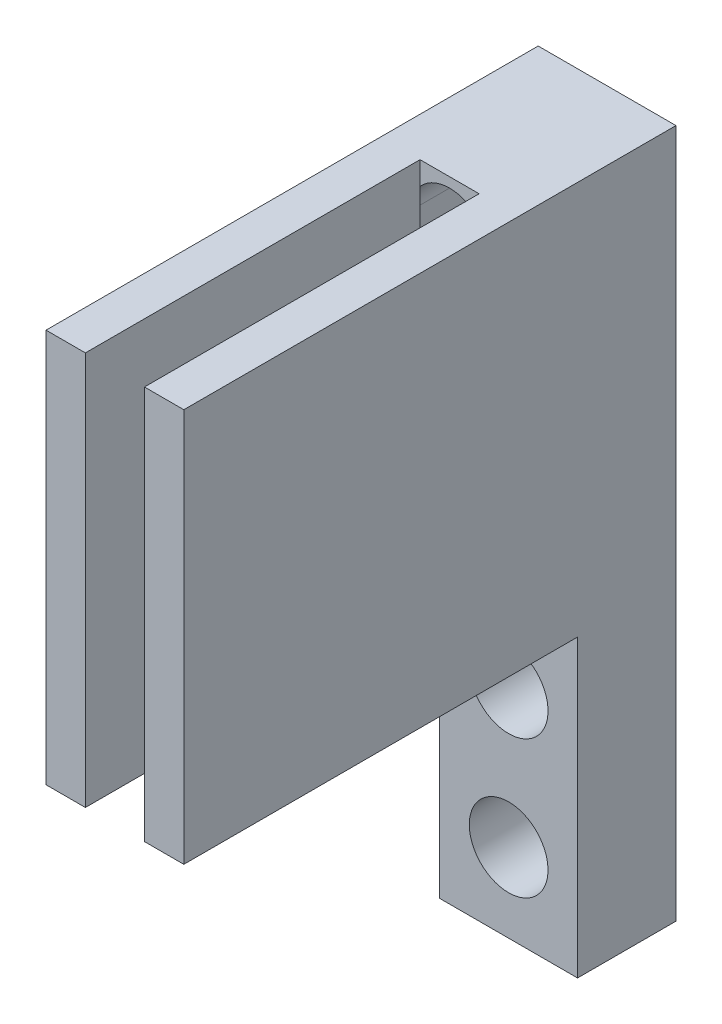
ISO-10303-21;
HEADER;
FILE_DESCRIPTION(('STEP AP214'),'2;1');
FILE_NAME('part.step','',(''),(''),'','','');
FILE_SCHEMA(('AUTOMOTIVE_DESIGN { 1 0 10303 214 1 1 1 1 }'));
ENDSEC;
DATA;
#1=APPLICATION_CONTEXT('core data for automotive mechanical design processes');
#2=APPLICATION_PROTOCOL_DEFINITION('international standard','automotive_design',2000,#1);
#3=PRODUCT_CONTEXT('',#1,'mechanical');
#4=PRODUCT('Part','Part','',(#3));
#5=PRODUCT_RELATED_PRODUCT_CATEGORY('part','',(#4));
#6=PRODUCT_DEFINITION_FORMATION('','',#4);
#7=PRODUCT_DEFINITION_CONTEXT('part definition',#1,'design');
#8=PRODUCT_DEFINITION('design','',#6,#7);
#9=PRODUCT_DEFINITION_SHAPE('','',#8);
#10=(LENGTH_UNIT() NAMED_UNIT(*) SI_UNIT(.MILLI.,.METRE.));
#11=(NAMED_UNIT(*) PLANE_ANGLE_UNIT() SI_UNIT($,.RADIAN.));
#12=(NAMED_UNIT(*) SI_UNIT($,.STERADIAN.) SOLID_ANGLE_UNIT());
#13=UNCERTAINTY_MEASURE_WITH_UNIT(LENGTH_MEASURE(1.E-05),#10,'distance_accuracy_value','');
#14=(GEOMETRIC_REPRESENTATION_CONTEXT(3) GLOBAL_UNCERTAINTY_ASSIGNED_CONTEXT((#13)) GLOBAL_UNIT_ASSIGNED_CONTEXT((#10,
#11,#12)) REPRESENTATION_CONTEXT('',''));
#15=CARTESIAN_POINT('',(0.,0.,0.));
#16=DIRECTION('',(0.,0.,1.));
#17=DIRECTION('',(1.,0.,0.));
#18=AXIS2_PLACEMENT_3D('',#15,#16,#17);
#19=CARTESIAN_POINT('',(-1.5,20.,-4.5));
#20=DIRECTION('',(0.,0.,-1.));
#21=DIRECTION('',(-1.,0.,0.));
#22=AXIS2_PLACEMENT_3D('',#19,#20,#21);
#23=PLANE('',#22);
#24=DIRECTION('',(0.,-1.,0.));
#25=VECTOR('',#24,1.);
#26=CARTESIAN_POINT('',(-1.5,20.,-4.5));
#27=LINE('',#26,#25);
#28=CARTESIAN_POINT('',(-1.5,20.,-4.5));
#29=VERTEX_POINT('',#28);
#30=CARTESIAN_POINT('',(-1.5,18.8228756555323,-4.5));
#31=VERTEX_POINT('',#30);
#32=EDGE_CURVE('E310',#29,#31,#27,.T.);
#33=ORIENTED_EDGE('',*,*,#32,.T.);
#34=CARTESIAN_POINT('',(0.,17.5,-4.5));
#35=DIRECTION('',(0.,0.,1.));
#36=DIRECTION('',(1.,0.,0.));
#37=AXIS2_PLACEMENT_3D('',#34,#35,#36);
#38=CIRCLE('',#37,2.);
#39=CARTESIAN_POINT('',(1.5,18.8228756555323,-4.5));
#40=VERTEX_POINT('',#39);
#41=EDGE_CURVE('E212',#40,#31,#38,.T.);
#42=ORIENTED_EDGE('',*,*,#41,.F.);
#43=DIRECTION('',(0.,-1.,0.));
#44=VECTOR('',#43,1.);
#45=CARTESIAN_POINT('',(1.5,20.,-4.5));
#46=LINE('',#45,#44);
#47=CARTESIAN_POINT('',(1.5,20.,-4.5));
#48=VERTEX_POINT('',#47);
#49=EDGE_CURVE('E304',#48,#40,#46,.T.);
#50=ORIENTED_EDGE('',*,*,#49,.F.);
#51=DIRECTION('',(1.,0.,0.));
#52=VECTOR('',#51,1.);
#53=CARTESIAN_POINT('',(-1.5,20.,-4.5));
#54=LINE('',#53,#52);
#55=EDGE_CURVE('E254',#29,#48,#54,.T.);
#56=ORIENTED_EDGE('',*,*,#55,.F.);
#57=EDGE_LOOP('',(#33,#42,#50,#56));
#58=FACE_BOUND('',#57,.T.);
#59=ADVANCED_FACE('F39',(#58),#23,.F.);
#60=CARTESIAN_POINT('',(-3.5,20.,12.5));
#61=DIRECTION('',(1.,0.,0.));
#62=DIRECTION('',(0.,0.,-1.));
#63=AXIS2_PLACEMENT_3D('',#60,#61,#62);
#64=PLANE('',#63);
#65=DIRECTION('',(0.,-1.,0.));
#66=VECTOR('',#65,1.);
#67=CARTESIAN_POINT('',(-3.5,20.,-12.5));
#68=LINE('',#67,#66);
#69=CARTESIAN_POINT('',(-3.5,20.,-12.5));
#70=VERTEX_POINT('',#69);
#71=CARTESIAN_POINT('',(-3.5,-15.,-12.5));
#72=VERTEX_POINT('',#71);
#73=EDGE_CURVE('E269',#70,#72,#68,.T.);
#74=ORIENTED_EDGE('',*,*,#73,.T.);
#75=DIRECTION('',(0.,0.,-1.));
#76=VECTOR('',#75,1.);
#77=CARTESIAN_POINT('',(-3.5,-15.,-7.5));
#78=LINE('',#77,#76);
#79=CARTESIAN_POINT('',(-3.5,-15.,-7.5));
#80=VERTEX_POINT('',#79);
#81=EDGE_CURVE('E166',#80,#72,#78,.T.);
#82=ORIENTED_EDGE('',*,*,#81,.F.);
#83=DIRECTION('',(0.,1.,0.));
#84=VECTOR('',#83,1.);
#85=CARTESIAN_POINT('',(-3.5,0.,-7.5));
#86=LINE('',#85,#84);
#87=CARTESIAN_POINT('',(-3.5,0.,-7.5));
#88=VERTEX_POINT('',#87);
#89=EDGE_CURVE('E171',#80,#88,#86,.T.);
#90=ORIENTED_EDGE('',*,*,#89,.T.);
#91=DIRECTION('',(0.,0.,1.));
#92=VECTOR('',#91,1.);
#93=CARTESIAN_POINT('',(-3.5,0.,12.5));
#94=LINE('',#93,#92);
#95=CARTESIAN_POINT('',(-3.5,0.,12.5));
#96=VERTEX_POINT('',#95);
#97=EDGE_CURVE('E243',#88,#96,#94,.T.);
#98=ORIENTED_EDGE('',*,*,#97,.T.);
#99=DIRECTION('',(0.,-1.,0.));
#100=VECTOR('',#99,1.);
#101=CARTESIAN_POINT('',(-3.5,20.,12.5));
#102=LINE('',#101,#100);
#103=CARTESIAN_POINT('',(-3.5,20.,12.5));
#104=VERTEX_POINT('',#103);
#105=EDGE_CURVE('E11',#104,#96,#102,.T.);
#106=ORIENTED_EDGE('',*,*,#105,.F.);
#107=DIRECTION('',(0.,0.,1.));
#108=VECTOR('',#107,1.);
#109=CARTESIAN_POINT('',(-3.5,20.,12.5));
#110=LINE('',#109,#108);
#111=EDGE_CURVE('E244',#70,#104,#110,.T.);
#112=ORIENTED_EDGE('',*,*,#111,.F.);
#113=EDGE_LOOP('',(#74,#82,#90,#98,#106,#112));
#114=FACE_BOUND('',#113,.T.);
#115=ADVANCED_FACE('F41',(#114),#64,.F.);
#116=CARTESIAN_POINT('',(-1.5,20.,12.5));
#117=DIRECTION('',(0.,0.,-1.));
#118=DIRECTION('',(-1.,0.,0.));
#119=AXIS2_PLACEMENT_3D('',#116,#117,#118);
#120=PLANE('',#119);
#121=DIRECTION('',(1.,0.,0.));
#122=VECTOR('',#121,1.);
#123=CARTESIAN_POINT('',(-1.5,0.,12.5));
#124=LINE('',#123,#122);
#125=CARTESIAN_POINT('',(-1.5,0.,12.5));
#126=VERTEX_POINT('',#125);
#127=EDGE_CURVE('E272',#96,#126,#124,.T.);
#128=ORIENTED_EDGE('',*,*,#127,.T.);
#129=DIRECTION('',(0.,-1.,0.));
#130=VECTOR('',#129,1.);
#131=CARTESIAN_POINT('',(-1.5,20.,12.5));
#132=LINE('',#131,#130);
#133=CARTESIAN_POINT('',(-1.5,20.,12.5));
#134=VERTEX_POINT('',#133);
#135=EDGE_CURVE('E48',#134,#126,#132,.T.);
#136=ORIENTED_EDGE('',*,*,#135,.F.);
#137=DIRECTION('',(1.,0.,0.));
#138=VECTOR('',#137,1.);
#139=CARTESIAN_POINT('',(-1.5,20.,12.5));
#140=LINE('',#139,#138);
#141=EDGE_CURVE('E248',#104,#134,#140,.T.);
#142=ORIENTED_EDGE('',*,*,#141,.F.);
#143=ORIENTED_EDGE('',*,*,#105,.T.);
#144=EDGE_LOOP('',(#128,#136,#142,#143));
#145=FACE_BOUND('',#144,.T.);
#146=ADVANCED_FACE('F381',(#145),#120,.F.);
#147=CARTESIAN_POINT('',(-1.5,20.,12.5));
#148=DIRECTION('',(-1.,0.,0.));
#149=DIRECTION('',(0.,0.,1.));
#150=AXIS2_PLACEMENT_3D('',#147,#148,#149);
#151=PLANE('',#150);
#152=DIRECTION('',(0.,0.,-1.));
#153=VECTOR('',#152,1.);
#154=CARTESIAN_POINT('',(-1.5,0.,12.5));
#155=LINE('',#154,#153);
#156=CARTESIAN_POINT('',(-1.5,0.,-4.5));
#157=VERTEX_POINT('',#156);
#158=EDGE_CURVE('E275',#126,#157,#155,.T.);
#159=ORIENTED_EDGE('',*,*,#158,.T.);
#160=CARTESIAN_POINT('',(-1.5,9.17712434446771,-4.5));
#161=VERTEX_POINT('',#160);
#162=EDGE_CURVE('E308',#161,#157,#27,.T.);
#163=ORIENTED_EDGE('',*,*,#162,.F.);
#164=DIRECTION('',(0.,1.,0.));
#165=VECTOR('',#164,1.);
#166=CARTESIAN_POINT('',(-1.5,20.,-4.5));
#167=LINE('',#166,#165);
#168=EDGE_CURVE('E239',#161,#31,#167,.T.);
#169=ORIENTED_EDGE('',*,*,#168,.T.);
#170=ORIENTED_EDGE('',*,*,#32,.F.);
#171=DIRECTION('',(0.,0.,-1.));
#172=VECTOR('',#171,1.);
#173=CARTESIAN_POINT('',(-1.5,20.,12.5));
#174=LINE('',#173,#172);
#175=EDGE_CURVE('E251',#134,#29,#174,.T.);
#176=ORIENTED_EDGE('',*,*,#175,.F.);
#177=ORIENTED_EDGE('',*,*,#135,.T.);
#178=EDGE_LOOP('',(#159,#163,#169,#170,#176,#177));
#179=FACE_BOUND('',#178,.T.);
#180=ADVANCED_FACE('F319',(#179),#151,.F.);
#181=CARTESIAN_POINT('',(1.5,9.1771243444677,-4.5));
#182=VERTEX_POINT('',#181);
#183=CARTESIAN_POINT('',(1.5,0.,-4.5));
#184=VERTEX_POINT('',#183);
#185=EDGE_CURVE('E303',#182,#184,#46,.T.);
#186=ORIENTED_EDGE('',*,*,#185,.F.);
#187=CARTESIAN_POINT('',(0.,10.5,-4.5));
#188=DIRECTION('',(0.,0.,1.));
#189=DIRECTION('',(1.,0.,0.));
#190=AXIS2_PLACEMENT_3D('',#187,#188,#189);
#191=CIRCLE('',#190,2.);
#192=EDGE_CURVE('E63',#161,#182,#191,.T.);
#193=ORIENTED_EDGE('',*,*,#192,.F.);
#194=ORIENTED_EDGE('',*,*,#162,.T.);
#195=DIRECTION('',(1.,0.,0.));
#196=VECTOR('',#195,1.);
#197=CARTESIAN_POINT('',(-1.5,0.,-4.5));
#198=LINE('',#197,#196);
#199=EDGE_CURVE('E279',#157,#184,#198,.T.);
#200=ORIENTED_EDGE('',*,*,#199,.T.);
#201=EDGE_LOOP('',(#186,#193,#194,#200));
#202=FACE_BOUND('',#201,.T.);
#203=ADVANCED_FACE('F332',(#202),#23,.F.);
#204=CARTESIAN_POINT('',(1.5,20.,-4.5));
#205=DIRECTION('',(1.,0.,0.));
#206=DIRECTION('',(0.,0.,-1.));
#207=AXIS2_PLACEMENT_3D('',#204,#205,#206);
#208=PLANE('',#207);
#209=DIRECTION('',(0.,0.,1.));
#210=VECTOR('',#209,1.);
#211=CARTESIAN_POINT('',(1.5,0.,-4.5));
#212=LINE('',#211,#210);
#213=CARTESIAN_POINT('',(1.5,0.,12.5));
#214=VERTEX_POINT('',#213);
#215=EDGE_CURVE('E283',#184,#214,#212,.T.);
#216=ORIENTED_EDGE('',*,*,#215,.T.);
#217=DIRECTION('',(0.,-1.,0.));
#218=VECTOR('',#217,1.);
#219=CARTESIAN_POINT('',(1.5,20.,12.5));
#220=LINE('',#219,#218);
#221=CARTESIAN_POINT('',(1.5,20.,12.5));
#222=VERTEX_POINT('',#221);
#223=EDGE_CURVE('E299',#222,#214,#220,.T.);
#224=ORIENTED_EDGE('',*,*,#223,.F.);
#225=DIRECTION('',(0.,0.,1.));
#226=VECTOR('',#225,1.);
#227=CARTESIAN_POINT('',(1.5,20.,-4.5));
#228=LINE('',#227,#226);
#229=EDGE_CURVE('E257',#48,#222,#228,.T.);
#230=ORIENTED_EDGE('',*,*,#229,.F.);
#231=ORIENTED_EDGE('',*,*,#49,.T.);
#232=EDGE_CURVE('E309',#40,#182,#46,.T.);
#233=ORIENTED_EDGE('',*,*,#232,.T.);
#234=ORIENTED_EDGE('',*,*,#185,.T.);
#235=EDGE_LOOP('',(#216,#224,#230,#231,#233,#234));
#236=FACE_BOUND('',#235,.T.);
#237=ADVANCED_FACE('F373',(#236),#208,.F.);
#238=CARTESIAN_POINT('',(3.5,20.,12.5));
#239=DIRECTION('',(0.,0.,-1.));
#240=DIRECTION('',(-1.,0.,0.));
#241=AXIS2_PLACEMENT_3D('',#238,#239,#240);
#242=PLANE('',#241);
#243=DIRECTION('',(1.,0.,0.));
#244=VECTOR('',#243,1.);
#245=CARTESIAN_POINT('',(3.5,0.,12.5));
#246=LINE('',#245,#244);
#247=CARTESIAN_POINT('',(3.5,0.,12.5));
#248=VERTEX_POINT('',#247);
#249=EDGE_CURVE('E286',#214,#248,#246,.T.);
#250=ORIENTED_EDGE('',*,*,#249,.T.);
#251=DIRECTION('',(0.,-1.,0.));
#252=VECTOR('',#251,1.);
#253=CARTESIAN_POINT('',(3.5,20.,12.5));
#254=LINE('',#253,#252);
#255=CARTESIAN_POINT('',(3.5,20.,12.5));
#256=VERTEX_POINT('',#255);
#257=EDGE_CURVE('E296',#256,#248,#254,.T.);
#258=ORIENTED_EDGE('',*,*,#257,.F.);
#259=DIRECTION('',(1.,0.,0.));
#260=VECTOR('',#259,1.);
#261=CARTESIAN_POINT('',(3.5,20.,12.5));
#262=LINE('',#261,#260);
#263=EDGE_CURVE('E260',#222,#256,#262,.T.);
#264=ORIENTED_EDGE('',*,*,#263,.F.);
#265=ORIENTED_EDGE('',*,*,#223,.T.);
#266=EDGE_LOOP('',(#250,#258,#264,#265));
#267=FACE_BOUND('',#266,.T.);
#268=ADVANCED_FACE('F384',(#267),#242,.F.);
#269=CARTESIAN_POINT('',(3.5,20.,12.5));
#270=DIRECTION('',(-1.,0.,0.));
#271=DIRECTION('',(0.,0.,1.));
#272=AXIS2_PLACEMENT_3D('',#269,#270,#271);
#273=PLANE('',#272);
#274=DIRECTION('',(0.,0.,-1.));
#275=VECTOR('',#274,1.);
#276=CARTESIAN_POINT('',(3.5,0.,12.5));
#277=LINE('',#276,#275);
#278=CARTESIAN_POINT('',(3.5,0.,-7.5));
#279=VERTEX_POINT('',#278);
#280=EDGE_CURVE('E178',#248,#279,#277,.T.);
#281=ORIENTED_EDGE('',*,*,#280,.T.);
#282=DIRECTION('',(0.,-1.,0.));
#283=VECTOR('',#282,1.);
#284=CARTESIAN_POINT('',(3.5,0.,-7.5));
#285=LINE('',#284,#283);
#286=CARTESIAN_POINT('',(3.5,-15.,-7.5));
#287=VERTEX_POINT('',#286);
#288=EDGE_CURVE('E55',#279,#287,#285,.T.);
#289=ORIENTED_EDGE('',*,*,#288,.T.);
#290=DIRECTION('',(0.,0.,-1.));
#291=VECTOR('',#290,1.);
#292=CARTESIAN_POINT('',(3.5,-15.,-7.5));
#293=LINE('',#292,#291);
#294=CARTESIAN_POINT('',(3.5,-15.,-12.5));
#295=VERTEX_POINT('',#294);
#296=EDGE_CURVE('E157',#287,#295,#293,.T.);
#297=ORIENTED_EDGE('',*,*,#296,.T.);
#298=DIRECTION('',(0.,-1.,0.));
#299=VECTOR('',#298,1.);
#300=CARTESIAN_POINT('',(3.5,20.,-12.5));
#301=LINE('',#300,#299);
#302=CARTESIAN_POINT('',(3.5,20.,-12.5));
#303=VERTEX_POINT('',#302);
#304=EDGE_CURVE('E293',#303,#295,#301,.T.);
#305=ORIENTED_EDGE('',*,*,#304,.F.);
#306=DIRECTION('',(0.,0.,-1.));
#307=VECTOR('',#306,1.);
#308=CARTESIAN_POINT('',(3.5,20.,12.5));
#309=LINE('',#308,#307);
#310=EDGE_CURVE('E263',#256,#303,#309,.T.);
#311=ORIENTED_EDGE('',*,*,#310,.F.);
#312=ORIENTED_EDGE('',*,*,#257,.T.);
#313=EDGE_LOOP('',(#281,#289,#297,#305,#311,#312));
#314=FACE_BOUND('',#313,.T.);
#315=ADVANCED_FACE('F175',(#314),#273,.F.);
#316=CARTESIAN_POINT('',(3.5,20.,-12.5));
#317=DIRECTION('',(0.,0.,1.));
#318=DIRECTION('',(1.,0.,0.));
#319=AXIS2_PLACEMENT_3D('',#316,#317,#318);
#320=PLANE('',#319);
#321=DIRECTION('',(0.,-1.,0.));
#322=VECTOR('',#321,1.);
#323=CARTESIAN_POINT('',(2.,17.5,-12.5));
#324=LINE('',#323,#322);
#325=CARTESIAN_POINT('',(2.,17.5,-12.5));
#326=VERTEX_POINT('',#325);
#327=CARTESIAN_POINT('',(2.,10.5,-12.5));
#328=VERTEX_POINT('',#327);
#329=EDGE_CURVE('E199',#326,#328,#324,.T.);
#330=ORIENTED_EDGE('',*,*,#329,.F.);
#331=CARTESIAN_POINT('',(0.,17.5,-12.5));
#332=DIRECTION('',(0.,0.,1.));
#333=DIRECTION('',(1.,0.,0.));
#334=AXIS2_PLACEMENT_3D('',#331,#332,#333);
#335=CIRCLE('',#334,2.);
#336=CARTESIAN_POINT('',(-2.,17.5,-12.5));
#337=VERTEX_POINT('',#336);
#338=EDGE_CURVE('E203',#337,#326,#335,.F.);
#339=ORIENTED_EDGE('',*,*,#338,.F.);
#340=DIRECTION('',(0.,1.,0.));
#341=VECTOR('',#340,1.);
#342=CARTESIAN_POINT('',(-2.,17.5,-12.5));
#343=LINE('',#342,#341);
#344=CARTESIAN_POINT('',(-2.,10.5,-12.5));
#345=VERTEX_POINT('',#344);
#346=EDGE_CURVE('E206',#345,#337,#343,.T.);
#347=ORIENTED_EDGE('',*,*,#346,.F.);
#348=CARTESIAN_POINT('',(0.,10.5,-12.5));
#349=DIRECTION('',(0.,0.,1.));
#350=DIRECTION('',(1.,0.,0.));
#351=AXIS2_PLACEMENT_3D('',#348,#349,#350);
#352=CIRCLE('',#351,2.);
#353=EDGE_CURVE('E195',#328,#345,#352,.F.);
#354=ORIENTED_EDGE('',*,*,#353,.F.);
#355=EDGE_LOOP('',(#330,#339,#347,#354));
#356=FACE_BOUND('',#355,.T.);
#357=ORIENTED_EDGE('',*,*,#304,.T.);
#358=DIRECTION('',(-1.,0.,0.));
#359=VECTOR('',#358,1.);
#360=CARTESIAN_POINT('',(3.5,-15.,-12.5));
#361=LINE('',#360,#359);
#362=EDGE_CURVE('E162',#295,#72,#361,.T.);
#363=ORIENTED_EDGE('',*,*,#362,.T.);
#364=ORIENTED_EDGE('',*,*,#73,.F.);
#365=DIRECTION('',(-1.,0.,0.));
#366=VECTOR('',#365,1.);
#367=CARTESIAN_POINT('',(3.5,20.,-12.5));
#368=LINE('',#367,#366);
#369=EDGE_CURVE('E266',#303,#70,#368,.T.);
#370=ORIENTED_EDGE('',*,*,#369,.F.);
#371=EDGE_LOOP('',(#357,#363,#364,#370));
#372=FACE_BOUND('',#371,.T.);
#373=CARTESIAN_POINT('',(0.,-4.,-12.5));
#374=DIRECTION('',(0.,0.,-1.));
#375=DIRECTION('',(-1.,0.,0.));
#376=AXIS2_PLACEMENT_3D('',#373,#374,#375);
#377=CIRCLE('',#376,2.);
#378=CARTESIAN_POINT('',(-2.,-4.,-12.5));
#379=VERTEX_POINT('',#378);
#380=EDGE_CURVE('E394',#379,#379,#377,.T.);
#381=ORIENTED_EDGE('',*,*,#380,.F.);
#382=EDGE_LOOP('',(#381));
#383=FACE_BOUND('',#382,.T.);
#384=CARTESIAN_POINT('',(0.,-11.,-12.5));
#385=DIRECTION('',(0.,0.,-1.));
#386=DIRECTION('',(-1.,0.,0.));
#387=AXIS2_PLACEMENT_3D('',#384,#385,#386);
#388=CIRCLE('',#387,2.);
#389=CARTESIAN_POINT('',(-2.,-11.,-12.5));
#390=VERTEX_POINT('',#389);
#391=EDGE_CURVE('E185',#390,#390,#388,.T.);
#392=ORIENTED_EDGE('',*,*,#391,.F.);
#393=EDGE_LOOP('',(#392));
#394=FACE_BOUND('',#393,.T.);
#395=ADVANCED_FACE('F359',(#356,#372,#383,#394),#320,.F.);
#396=CARTESIAN_POINT('',(0.,20.,0.));
#397=DIRECTION('',(0.,1.,0.));
#398=DIRECTION('',(0.,0.,1.));
#399=AXIS2_PLACEMENT_3D('',#396,#397,#398);
#400=PLANE('',#399);
#401=ORIENTED_EDGE('',*,*,#111,.T.);
#402=ORIENTED_EDGE('',*,*,#141,.T.);
#403=ORIENTED_EDGE('',*,*,#175,.T.);
#404=ORIENTED_EDGE('',*,*,#55,.T.);
#405=ORIENTED_EDGE('',*,*,#229,.T.);
#406=ORIENTED_EDGE('',*,*,#263,.T.);
#407=ORIENTED_EDGE('',*,*,#310,.T.);
#408=ORIENTED_EDGE('',*,*,#369,.T.);
#409=EDGE_LOOP('',(#401,#402,#403,#404,#405,#406,#407,#408));
#410=FACE_BOUND('',#409,.T.);
#411=ADVANCED_FACE('F377',(#410),#400,.T.);
#412=CARTESIAN_POINT('',(0.,0.,0.));
#413=DIRECTION('',(0.,1.,0.));
#414=DIRECTION('',(0.,0.,1.));
#415=AXIS2_PLACEMENT_3D('',#412,#413,#414);
#416=PLANE('',#415);
#417=ORIENTED_EDGE('',*,*,#97,.F.);
#418=DIRECTION('',(1.,0.,0.));
#419=VECTOR('',#418,1.);
#420=CARTESIAN_POINT('',(3.5,0.,-7.5));
#421=LINE('',#420,#419);
#422=EDGE_CURVE('E167',#88,#279,#421,.T.);
#423=ORIENTED_EDGE('',*,*,#422,.T.);
#424=ORIENTED_EDGE('',*,*,#280,.F.);
#425=ORIENTED_EDGE('',*,*,#249,.F.);
#426=ORIENTED_EDGE('',*,*,#215,.F.);
#427=ORIENTED_EDGE('',*,*,#199,.F.);
#428=ORIENTED_EDGE('',*,*,#158,.F.);
#429=ORIENTED_EDGE('',*,*,#127,.F.);
#430=EDGE_LOOP('',(#417,#423,#424,#425,#426,#427,#428,#429));
#431=FACE_BOUND('',#430,.T.);
#432=ADVANCED_FACE('F327',(#431),#416,.F.);
#433=CARTESIAN_POINT('',(0.,17.5,-4.5));
#434=DIRECTION('',(0.,0.,1.));
#435=DIRECTION('',(1.,0.,0.));
#436=AXIS2_PLACEMENT_3D('',#433,#434,#435);
#437=PLANE('',#436);
#438=CARTESIAN_POINT('',(-2.,10.5,-4.5));
#439=VERTEX_POINT('',#438);
#440=EDGE_CURVE('E217',#439,#161,#191,.T.);
#441=ORIENTED_EDGE('',*,*,#440,.F.);
#442=DIRECTION('',(0.,-1.,0.));
#443=VECTOR('',#442,1.);
#444=CARTESIAN_POINT('',(-2.,17.5,-4.5));
#445=LINE('',#444,#443);
#446=CARTESIAN_POINT('',(-2.,17.5,-4.5));
#447=VERTEX_POINT('',#446);
#448=EDGE_CURVE('E211',#447,#439,#445,.T.);
#449=ORIENTED_EDGE('',*,*,#448,.F.);
#450=EDGE_CURVE('E193',#31,#447,#38,.T.);
#451=ORIENTED_EDGE('',*,*,#450,.F.);
#452=ORIENTED_EDGE('',*,*,#168,.F.);
#453=EDGE_LOOP('',(#441,#449,#451,#452));
#454=FACE_BOUND('',#453,.T.);
#455=ADVANCED_FACE('F353',(#454),#437,.F.);
#456=CARTESIAN_POINT('',(2.,17.5,-4.5));
#457=VERTEX_POINT('',#456);
#458=EDGE_CURVE('E207',#457,#40,#38,.T.);
#459=ORIENTED_EDGE('',*,*,#458,.F.);
#460=DIRECTION('',(0.,1.,0.));
#461=VECTOR('',#460,1.);
#462=CARTESIAN_POINT('',(2.,17.5,-4.5));
#463=LINE('',#462,#461);
#464=CARTESIAN_POINT('',(2.,10.5,-4.5));
#465=VERTEX_POINT('',#464);
#466=EDGE_CURVE('E220',#465,#457,#463,.T.);
#467=ORIENTED_EDGE('',*,*,#466,.F.);
#468=EDGE_CURVE('E216',#182,#465,#191,.T.);
#469=ORIENTED_EDGE('',*,*,#468,.F.);
#470=ORIENTED_EDGE('',*,*,#232,.F.);
#471=EDGE_LOOP('',(#459,#467,#469,#470));
#472=FACE_BOUND('',#471,.T.);
#473=ADVANCED_FACE('F367',(#472),#437,.F.);
#474=CARTESIAN_POINT('',(0.,17.5,-24.2046999107196));
#475=DIRECTION('',(0.,0.,1.));
#476=DIRECTION('',(1.,0.,0.));
#477=AXIS2_PLACEMENT_3D('',#474,#475,#476);
#478=CYLINDRICAL_SURFACE('',#477,2.);
#479=ORIENTED_EDGE('',*,*,#338,.T.);
#480=DIRECTION('',(0.,0.,1.));
#481=VECTOR('',#480,1.);
#482=CARTESIAN_POINT('',(2.,17.5,-24.2046999107196));
#483=LINE('',#482,#481);
#484=EDGE_CURVE('E200',#326,#457,#483,.T.);
#485=ORIENTED_EDGE('',*,*,#484,.T.);
#486=ORIENTED_EDGE('',*,*,#458,.T.);
#487=ORIENTED_EDGE('',*,*,#41,.T.);
#488=ORIENTED_EDGE('',*,*,#450,.T.);
#489=DIRECTION('',(0.,0.,1.));
#490=VECTOR('',#489,1.);
#491=CARTESIAN_POINT('',(-2.,17.5,-24.2046999107196));
#492=LINE('',#491,#490);
#493=EDGE_CURVE('E224',#337,#447,#492,.T.);
#494=ORIENTED_EDGE('',*,*,#493,.F.);
#495=EDGE_LOOP('',(#479,#485,#486,#487,#488,#494));
#496=FACE_BOUND('',#495,.T.);
#497=ADVANCED_FACE('F344',(#496),#478,.F.);
#498=CARTESIAN_POINT('',(2.,17.5,-24.2046999107196));
#499=DIRECTION('',(1.,0.,0.));
#500=DIRECTION('',(0.,1.,0.));
#501=AXIS2_PLACEMENT_3D('',#498,#499,#500);
#502=PLANE('',#501);
#503=ORIENTED_EDGE('',*,*,#329,.T.);
#504=DIRECTION('',(0.,0.,1.));
#505=VECTOR('',#504,1.);
#506=CARTESIAN_POINT('',(2.,10.5,-24.2046999107196));
#507=LINE('',#506,#505);
#508=EDGE_CURVE('E227',#328,#465,#507,.T.);
#509=ORIENTED_EDGE('',*,*,#508,.T.);
#510=ORIENTED_EDGE('',*,*,#466,.T.);
#511=ORIENTED_EDGE('',*,*,#484,.F.);
#512=EDGE_LOOP('',(#503,#509,#510,#511));
#513=FACE_BOUND('',#512,.T.);
#514=ADVANCED_FACE('F364',(#513),#502,.F.);
#515=CARTESIAN_POINT('',(0.,10.5,-24.2046999107196));
#516=DIRECTION('',(0.,0.,1.));
#517=DIRECTION('',(1.,0.,0.));
#518=AXIS2_PLACEMENT_3D('',#515,#516,#517);
#519=CYLINDRICAL_SURFACE('',#518,2.);
#520=ORIENTED_EDGE('',*,*,#353,.T.);
#521=DIRECTION('',(0.,0.,1.));
#522=VECTOR('',#521,1.);
#523=CARTESIAN_POINT('',(-2.,10.5,-24.2046999107196));
#524=LINE('',#523,#522);
#525=EDGE_CURVE('E231',#345,#439,#524,.T.);
#526=ORIENTED_EDGE('',*,*,#525,.T.);
#527=ORIENTED_EDGE('',*,*,#440,.T.);
#528=ORIENTED_EDGE('',*,*,#192,.T.);
#529=ORIENTED_EDGE('',*,*,#468,.T.);
#530=ORIENTED_EDGE('',*,*,#508,.F.);
#531=EDGE_LOOP('',(#520,#526,#527,#528,#529,#530));
#532=FACE_BOUND('',#531,.T.);
#533=ADVANCED_FACE('F354',(#532),#519,.F.);
#534=CARTESIAN_POINT('',(-2.,17.5,-24.2046999107196));
#535=DIRECTION('',(-1.,0.,0.));
#536=DIRECTION('',(0.,-1.,0.));
#537=AXIS2_PLACEMENT_3D('',#534,#535,#536);
#538=PLANE('',#537);
#539=ORIENTED_EDGE('',*,*,#346,.T.);
#540=ORIENTED_EDGE('',*,*,#493,.T.);
#541=ORIENTED_EDGE('',*,*,#448,.T.);
#542=ORIENTED_EDGE('',*,*,#525,.F.);
#543=EDGE_LOOP('',(#539,#540,#541,#542));
#544=FACE_BOUND('',#543,.T.);
#545=ADVANCED_FACE('F350',(#544),#538,.F.);
#546=CARTESIAN_POINT('',(3.5,-15.,-7.5));
#547=DIRECTION('',(0.,-1.,0.));
#548=DIRECTION('',(0.,0.,-1.));
#549=AXIS2_PLACEMENT_3D('',#546,#547,#548);
#550=PLANE('',#549);
#551=ORIENTED_EDGE('',*,*,#362,.F.);
#552=ORIENTED_EDGE('',*,*,#296,.F.);
#553=DIRECTION('',(-1.,0.,0.));
#554=VECTOR('',#553,1.);
#555=CARTESIAN_POINT('',(3.5,-15.,-7.5));
#556=LINE('',#555,#554);
#557=EDGE_CURVE('E160',#287,#80,#556,.T.);
#558=ORIENTED_EDGE('',*,*,#557,.T.);
#559=ORIENTED_EDGE('',*,*,#81,.T.);
#560=EDGE_LOOP('',(#551,#552,#558,#559));
#561=FACE_BOUND('',#560,.T.);
#562=ADVANCED_FACE('F158',(#561),#550,.T.);
#563=CARTESIAN_POINT('',(0.,0.,-7.5));
#564=DIRECTION('',(0.,0.,-1.));
#565=DIRECTION('',(-1.,0.,0.));
#566=AXIS2_PLACEMENT_3D('',#563,#564,#565);
#567=PLANE('',#566);
#568=CARTESIAN_POINT('',(0.,-4.,-7.5));
#569=DIRECTION('',(0.,0.,-1.));
#570=DIRECTION('',(-1.,0.,0.));
#571=AXIS2_PLACEMENT_3D('',#568,#569,#570);
#572=CIRCLE('',#571,2.);
#573=CARTESIAN_POINT('',(-2.,-4.,-7.5));
#574=VERTEX_POINT('',#573);
#575=EDGE_CURVE('E399',#574,#574,#572,.T.);
#576=ORIENTED_EDGE('',*,*,#575,.T.);
#577=EDGE_LOOP('',(#576));
#578=FACE_BOUND('',#577,.T.);
#579=CARTESIAN_POINT('',(0.,-11.,-7.5));
#580=DIRECTION('',(0.,0.,-1.));
#581=DIRECTION('',(-1.,0.,0.));
#582=AXIS2_PLACEMENT_3D('',#579,#580,#581);
#583=CIRCLE('',#582,2.);
#584=CARTESIAN_POINT('',(-2.,-11.,-7.5));
#585=VERTEX_POINT('',#584);
#586=EDGE_CURVE('E182',#585,#585,#583,.T.);
#587=ORIENTED_EDGE('',*,*,#586,.T.);
#588=EDGE_LOOP('',(#587));
#589=FACE_BOUND('',#588,.T.);
#590=ORIENTED_EDGE('',*,*,#288,.F.);
#591=ORIENTED_EDGE('',*,*,#422,.F.);
#592=ORIENTED_EDGE('',*,*,#89,.F.);
#593=ORIENTED_EDGE('',*,*,#557,.F.);
#594=EDGE_LOOP('',(#590,#591,#592,#593));
#595=FACE_BOUND('',#594,.T.);
#596=ADVANCED_FACE('F170',(#578,#589,#595),#567,.F.);
#597=CARTESIAN_POINT('',(0.,-11.,-7.5));
#598=DIRECTION('',(0.,0.,-1.));
#599=DIRECTION('',(-1.,0.,0.));
#600=AXIS2_PLACEMENT_3D('',#597,#598,#599);
#601=CYLINDRICAL_SURFACE('',#600,2.);
#602=ORIENTED_EDGE('',*,*,#586,.F.);
#603=EDGE_LOOP('',(#602));
#604=FACE_BOUND('',#603,.T.);
#605=ORIENTED_EDGE('',*,*,#391,.T.);
#606=EDGE_LOOP('',(#605));
#607=FACE_BOUND('',#606,.T.);
#608=ADVANCED_FACE('F412',(#604,#607),#601,.F.);
#609=CARTESIAN_POINT('',(0.,-4.,-7.5));
#610=DIRECTION('',(0.,0.,-1.));
#611=DIRECTION('',(-1.,0.,0.));
#612=AXIS2_PLACEMENT_3D('',#609,#610,#611);
#613=CYLINDRICAL_SURFACE('',#612,2.);
#614=ORIENTED_EDGE('',*,*,#575,.F.);
#615=EDGE_LOOP('',(#614));
#616=FACE_BOUND('',#615,.T.);
#617=ORIENTED_EDGE('',*,*,#380,.T.);
#618=EDGE_LOOP('',(#617));
#619=FACE_BOUND('',#618,.T.);
#620=ADVANCED_FACE('F410',(#616,#619),#613,.F.);
#621=CLOSED_SHELL('',(#59,#115,#146,#180,#203,#237,#268,#315,#395,#411,#432,#455,#473,#497,#514,
#533,#545,#562,#596,#608,#620));
#622=MANIFOLD_SOLID_BREP('B2',#621);
#623=ADVANCED_BREP_SHAPE_REPRESENTATION('',(#18,#622),#14);
#624=SHAPE_DEFINITION_REPRESENTATION(#9,#623);
ENDSEC;
END-ISO-10303-21;
